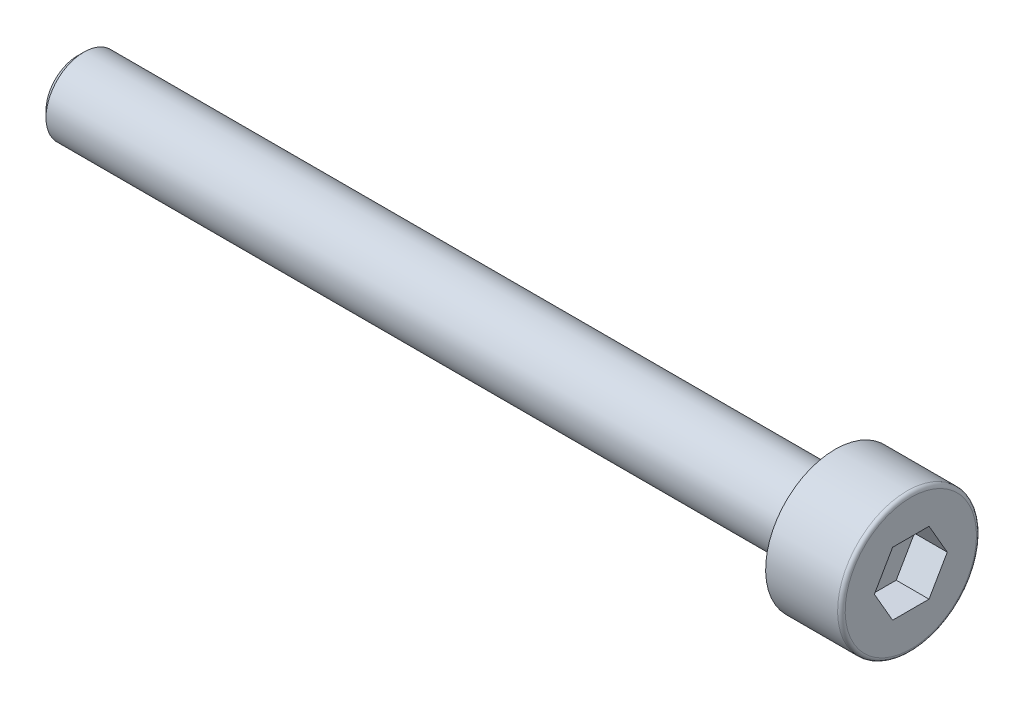
ISO-10303-21;
HEADER;
FILE_DESCRIPTION(('STEP AP214'),'2;1');
FILE_NAME('part.step','',(''),(''),'','','');
FILE_SCHEMA(('AUTOMOTIVE_DESIGN { 1 0 10303 214 1 1 1 1 }'));
ENDSEC;
DATA;
#1=APPLICATION_CONTEXT('core data for automotive mechanical design processes');
#2=APPLICATION_PROTOCOL_DEFINITION('international standard','automotive_design',2000,#1);
#3=PRODUCT_CONTEXT('',#1,'mechanical');
#4=PRODUCT('Part','Part','',(#3));
#5=PRODUCT_RELATED_PRODUCT_CATEGORY('part','',(#4));
#6=PRODUCT_DEFINITION_FORMATION('','',#4);
#7=PRODUCT_DEFINITION_CONTEXT('part definition',#1,'design');
#8=PRODUCT_DEFINITION('design','',#6,#7);
#9=PRODUCT_DEFINITION_SHAPE('','',#8);
#10=(LENGTH_UNIT() NAMED_UNIT(*) SI_UNIT(.MILLI.,.METRE.));
#11=(NAMED_UNIT(*) PLANE_ANGLE_UNIT() SI_UNIT($,.RADIAN.));
#12=(NAMED_UNIT(*) SI_UNIT($,.STERADIAN.) SOLID_ANGLE_UNIT());
#13=UNCERTAINTY_MEASURE_WITH_UNIT(LENGTH_MEASURE(1.E-05),#10,'distance_accuracy_value','');
#14=(GEOMETRIC_REPRESENTATION_CONTEXT(3) GLOBAL_UNCERTAINTY_ASSIGNED_CONTEXT((#13)) GLOBAL_UNIT_ASSIGNED_CONTEXT((#10,
#11,#12)) REPRESENTATION_CONTEXT('',''));
#15=CARTESIAN_POINT('',(0.,0.,0.));
#16=DIRECTION('',(0.,0.,1.));
#17=DIRECTION('',(1.,0.,0.));
#18=AXIS2_PLACEMENT_3D('',#15,#16,#17);
#19=CARTESIAN_POINT('',(0.,0.,0.));
#20=DIRECTION('',(1.,0.,0.));
#21=DIRECTION('',(0.,1.,0.));
#22=AXIS2_PLACEMENT_3D('',#19,#20,#21);
#23=PLANE('',#22);
#24=DIRECTION('',(0.,-0.866025403784439,0.5));
#25=VECTOR('',#24,1.);
#26=CARTESIAN_POINT('',(0.,1.25,0.721687836487035));
#27=LINE('',#26,#25);
#28=CARTESIAN_POINT('',(0.,1.25,0.721687836487035));
#29=VERTEX_POINT('',#28);
#30=CARTESIAN_POINT('',(0.,0.,1.44337567297407));
#31=VERTEX_POINT('',#30);
#32=EDGE_CURVE('E30',#29,#31,#27,.T.);
#33=ORIENTED_EDGE('',*,*,#32,.F.);
#34=DIRECTION('',(0.,0.,1.));
#35=VECTOR('',#34,1.);
#36=CARTESIAN_POINT('',(0.,1.25,-0.721687836487035));
#37=LINE('',#36,#35);
#38=CARTESIAN_POINT('',(0.,1.25,-0.721687836487035));
#39=VERTEX_POINT('',#38);
#40=EDGE_CURVE('E113',#39,#29,#37,.T.);
#41=ORIENTED_EDGE('',*,*,#40,.F.);
#42=DIRECTION('',(0.,0.866025403784439,0.5));
#43=VECTOR('',#42,1.);
#44=CARTESIAN_POINT('',(0.,0.,-1.44337567297406));
#45=LINE('',#44,#43);
#46=CARTESIAN_POINT('',(0.,0.,-1.44337567297406));
#47=VERTEX_POINT('',#46);
#48=EDGE_CURVE('E111',#47,#39,#45,.T.);
#49=ORIENTED_EDGE('',*,*,#48,.F.);
#50=DIRECTION('',(0.,0.866025403784439,-0.5));
#51=VECTOR('',#50,1.);
#52=CARTESIAN_POINT('',(0.,-1.25,-0.721687836487029));
#53=LINE('',#52,#51);
#54=CARTESIAN_POINT('',(0.,-1.25,-0.721687836487029));
#55=VERTEX_POINT('',#54);
#56=EDGE_CURVE('E78',#55,#47,#53,.T.);
#57=ORIENTED_EDGE('',*,*,#56,.F.);
#58=DIRECTION('',(0.,0.,-1.));
#59=VECTOR('',#58,1.);
#60=CARTESIAN_POINT('',(0.,-1.25,0.721687836487035));
#61=LINE('',#60,#59);
#62=CARTESIAN_POINT('',(0.,-1.25,0.721687836487035));
#63=VERTEX_POINT('',#62);
#64=EDGE_CURVE('E107',#63,#55,#61,.T.);
#65=ORIENTED_EDGE('',*,*,#64,.F.);
#66=DIRECTION('',(0.,-0.866025403784439,-0.5));
#67=VECTOR('',#66,1.);
#68=CARTESIAN_POINT('',(0.,0.,1.44337567297407));
#69=LINE('',#68,#67);
#70=EDGE_CURVE('E104',#31,#63,#69,.T.);
#71=ORIENTED_EDGE('',*,*,#70,.F.);
#72=EDGE_LOOP('',(#33,#41,#49,#57,#65,#71));
#73=FACE_BOUND('',#72,.T.);
#74=CARTESIAN_POINT('',(0.,0.,0.));
#75=DIRECTION('',(1.,0.,0.));
#76=DIRECTION('',(0.,1.,0.));
#77=AXIS2_PLACEMENT_3D('',#74,#75,#76);
#78=CIRCLE('',#77,2.6);
#79=CARTESIAN_POINT('',(0.,2.6,0.));
#80=VERTEX_POINT('',#79);
#81=EDGE_CURVE('E131',#80,#80,#78,.T.);
#82=ORIENTED_EDGE('',*,*,#81,.T.);
#83=EDGE_LOOP('',(#82));
#84=FACE_BOUND('',#83,.T.);
#85=ADVANCED_FACE('F15',(#73,#84),#23,.T.);
#86=CARTESIAN_POINT('',(-0.15,0.,0.));
#87=DIRECTION('',(1.,0.,0.));
#88=DIRECTION('',(0.,1.,0.));
#89=AXIS2_PLACEMENT_3D('',#86,#87,#88);
#90=TOROIDAL_SURFACE('',#89,2.6,0.15);
#91=CARTESIAN_POINT('',(-0.15,0.,0.));
#92=DIRECTION('',(1.,0.,0.));
#93=DIRECTION('',(0.,1.,0.));
#94=AXIS2_PLACEMENT_3D('',#91,#92,#93);
#95=CIRCLE('',#94,2.75);
#96=CARTESIAN_POINT('',(-0.15,2.75,0.));
#97=VERTEX_POINT('',#96);
#98=EDGE_CURVE('E128',#97,#97,#95,.T.);
#99=ORIENTED_EDGE('',*,*,#98,.T.);
#100=EDGE_LOOP('',(#99));
#101=FACE_BOUND('',#100,.T.);
#102=ORIENTED_EDGE('',*,*,#81,.F.);
#103=EDGE_LOOP('',(#102));
#104=FACE_BOUND('',#103,.T.);
#105=ADVANCED_FACE('F150',(#101,#104),#90,.T.);
#106=CARTESIAN_POINT('',(0.,0.,0.));
#107=DIRECTION('',(1.,0.,0.));
#108=DIRECTION('',(0.,1.,0.));
#109=AXIS2_PLACEMENT_3D('',#106,#107,#108);
#110=CYLINDRICAL_SURFACE('',#109,2.75);
#111=CARTESIAN_POINT('',(-3.,0.,0.));
#112=DIRECTION('',(1.,0.,0.));
#113=DIRECTION('',(0.,1.,0.));
#114=AXIS2_PLACEMENT_3D('',#111,#112,#113);
#115=CIRCLE('',#114,2.75);
#116=CARTESIAN_POINT('',(-3.,2.75,0.));
#117=VERTEX_POINT('',#116);
#118=EDGE_CURVE('E125',#117,#117,#115,.T.);
#119=ORIENTED_EDGE('',*,*,#118,.T.);
#120=EDGE_LOOP('',(#119));
#121=FACE_BOUND('',#120,.T.);
#122=ORIENTED_EDGE('',*,*,#98,.F.);
#123=EDGE_LOOP('',(#122));
#124=FACE_BOUND('',#123,.T.);
#125=ADVANCED_FACE('F156',(#121,#124),#110,.T.);
#126=CARTESIAN_POINT('',(-3.,2.75,0.));
#127=DIRECTION('',(-1.,0.,0.));
#128=DIRECTION('',(0.,-1.,0.));
#129=AXIS2_PLACEMENT_3D('',#126,#127,#128);
#130=PLANE('',#129);
#131=CARTESIAN_POINT('',(-3.,0.,0.));
#132=DIRECTION('',(1.,0.,0.));
#133=DIRECTION('',(0.,1.,0.));
#134=AXIS2_PLACEMENT_3D('',#131,#132,#133);
#135=CIRCLE('',#134,1.5);
#136=CARTESIAN_POINT('',(-3.,1.5,0.));
#137=VERTEX_POINT('',#136);
#138=EDGE_CURVE('E117',#137,#137,#135,.T.);
#139=ORIENTED_EDGE('',*,*,#138,.T.);
#140=EDGE_LOOP('',(#139));
#141=FACE_BOUND('',#140,.T.);
#142=ORIENTED_EDGE('',*,*,#118,.F.);
#143=EDGE_LOOP('',(#142));
#144=FACE_BOUND('',#143,.T.);
#145=ADVANCED_FACE('F163',(#141,#144),#130,.T.);
#146=CARTESIAN_POINT('',(0.,0.,0.));
#147=DIRECTION('',(1.,0.,0.));
#148=DIRECTION('',(0.,1.,0.));
#149=AXIS2_PLACEMENT_3D('',#146,#147,#148);
#150=CYLINDRICAL_SURFACE('',#149,1.5);
#151=CARTESIAN_POINT('',(-32.75,0.,0.));
#152=DIRECTION('',(-1.,0.,0.));
#153=DIRECTION('',(0.,-1.,0.));
#154=AXIS2_PLACEMENT_3D('',#151,#152,#153);
#155=CIRCLE('',#154,1.5);
#156=CARTESIAN_POINT('',(-32.75,-1.5,0.));
#157=VERTEX_POINT('',#156);
#158=EDGE_CURVE('E23',#157,#157,#155,.F.);
#159=ORIENTED_EDGE('',*,*,#158,.T.);
#160=EDGE_LOOP('',(#159));
#161=FACE_BOUND('',#160,.T.);
#162=ORIENTED_EDGE('',*,*,#138,.F.);
#163=EDGE_LOOP('',(#162));
#164=FACE_BOUND('',#163,.T.);
#165=ADVANCED_FACE('F136',(#161,#164),#150,.T.);
#166=CARTESIAN_POINT('',(-33.,1.5,0.));
#167=DIRECTION('',(-1.,0.,0.));
#168=DIRECTION('',(0.,-1.,0.));
#169=AXIS2_PLACEMENT_3D('',#166,#167,#168);
#170=PLANE('',#169);
#171=CARTESIAN_POINT('',(-33.,0.,0.));
#172=DIRECTION('',(-1.,0.,0.));
#173=DIRECTION('',(0.,-1.,0.));
#174=AXIS2_PLACEMENT_3D('',#171,#172,#173);
#175=CIRCLE('',#174,1.25);
#176=CARTESIAN_POINT('',(-33.,-1.25,0.));
#177=VERTEX_POINT('',#176);
#178=EDGE_CURVE('E9',#177,#177,#175,.T.);
#179=ORIENTED_EDGE('',*,*,#178,.T.);
#180=EDGE_LOOP('',(#179));
#181=FACE_BOUND('',#180,.T.);
#182=ADVANCED_FACE('F170',(#181),#170,.T.);
#183=CARTESIAN_POINT('',(-1.3,1.25,0.721687836487035));
#184=DIRECTION('',(0.,0.5,0.866025403784439));
#185=DIRECTION('',(0.,-0.866025403784439,0.5));
#186=AXIS2_PLACEMENT_3D('',#183,#184,#185);
#187=PLANE('',#186);
#188=ORIENTED_EDGE('',*,*,#32,.T.);
#189=DIRECTION('',(1.,0.,0.));
#190=VECTOR('',#189,1.);
#191=CARTESIAN_POINT('',(-1.3,0.,1.44337567297407));
#192=LINE('',#191,#190);
#193=CARTESIAN_POINT('',(-1.3,0.,1.44337567297407));
#194=VERTEX_POINT('',#193);
#195=EDGE_CURVE('E60',#194,#31,#192,.T.);
#196=ORIENTED_EDGE('',*,*,#195,.F.);
#197=DIRECTION('',(0.,-0.866025403784439,0.5));
#198=VECTOR('',#197,1.);
#199=CARTESIAN_POINT('',(-1.3,1.25,0.721687836487035));
#200=LINE('',#199,#198);
#201=CARTESIAN_POINT('',(-1.3,1.25,0.721687836487035));
#202=VERTEX_POINT('',#201);
#203=EDGE_CURVE('E115',#202,#194,#200,.T.);
#204=ORIENTED_EDGE('',*,*,#203,.F.);
#205=DIRECTION('',(1.,0.,0.));
#206=VECTOR('',#205,1.);
#207=CARTESIAN_POINT('',(-1.3,1.25,0.721687836487035));
#208=LINE('',#207,#206);
#209=EDGE_CURVE('E38',#202,#29,#208,.T.);
#210=ORIENTED_EDGE('',*,*,#209,.T.);
#211=EDGE_LOOP('',(#188,#196,#204,#210));
#212=FACE_BOUND('',#211,.T.);
#213=ADVANCED_FACE('F173',(#212),#187,.F.);
#214=CARTESIAN_POINT('',(-1.3,1.25,-0.721687836487035));
#215=DIRECTION('',(0.,1.,0.));
#216=DIRECTION('',(-1.,0.,0.));
#217=AXIS2_PLACEMENT_3D('',#214,#215,#216);
#218=PLANE('',#217);
#219=ORIENTED_EDGE('',*,*,#40,.T.);
#220=ORIENTED_EDGE('',*,*,#209,.F.);
#221=DIRECTION('',(0.,0.,1.));
#222=VECTOR('',#221,1.);
#223=CARTESIAN_POINT('',(-1.3,1.25,-0.721687836487035));
#224=LINE('',#223,#222);
#225=CARTESIAN_POINT('',(-1.3,1.25,-0.721687836487035));
#226=VERTEX_POINT('',#225);
#227=EDGE_CURVE('E90',#226,#202,#224,.T.);
#228=ORIENTED_EDGE('',*,*,#227,.F.);
#229=DIRECTION('',(1.,0.,0.));
#230=VECTOR('',#229,1.);
#231=CARTESIAN_POINT('',(-1.3,1.25,-0.721687836487035));
#232=LINE('',#231,#230);
#233=EDGE_CURVE('E82',#226,#39,#232,.T.);
#234=ORIENTED_EDGE('',*,*,#233,.T.);
#235=EDGE_LOOP('',(#219,#220,#228,#234));
#236=FACE_BOUND('',#235,.T.);
#237=ADVANCED_FACE('F177',(#236),#218,.F.);
#238=CARTESIAN_POINT('',(-1.3,0.,-1.44337567297406));
#239=DIRECTION('',(0.,0.5,-0.866025403784439));
#240=DIRECTION('',(0.,0.866025403784439,0.5));
#241=AXIS2_PLACEMENT_3D('',#238,#239,#240);
#242=PLANE('',#241);
#243=ORIENTED_EDGE('',*,*,#48,.T.);
#244=ORIENTED_EDGE('',*,*,#233,.F.);
#245=DIRECTION('',(0.,0.866025403784439,0.5));
#246=VECTOR('',#245,1.);
#247=CARTESIAN_POINT('',(-1.3,0.,-1.44337567297406));
#248=LINE('',#247,#246);
#249=CARTESIAN_POINT('',(-1.3,0.,-1.44337567297406));
#250=VERTEX_POINT('',#249);
#251=EDGE_CURVE('E86',#250,#226,#248,.T.);
#252=ORIENTED_EDGE('',*,*,#251,.F.);
#253=DIRECTION('',(1.,0.,0.));
#254=VECTOR('',#253,1.);
#255=CARTESIAN_POINT('',(-1.3,0.,-1.44337567297406));
#256=LINE('',#255,#254);
#257=EDGE_CURVE('E71',#250,#47,#256,.T.);
#258=ORIENTED_EDGE('',*,*,#257,.T.);
#259=EDGE_LOOP('',(#243,#244,#252,#258));
#260=FACE_BOUND('',#259,.T.);
#261=ADVANCED_FACE('F87',(#260),#242,.F.);
#262=CARTESIAN_POINT('',(-1.3,-1.25,-0.721687836487029));
#263=DIRECTION('',(0.,-0.5,-0.866025403784439));
#264=DIRECTION('',(0.,0.866025403784439,-0.5));
#265=AXIS2_PLACEMENT_3D('',#262,#263,#264);
#266=PLANE('',#265);
#267=ORIENTED_EDGE('',*,*,#56,.T.);
#268=ORIENTED_EDGE('',*,*,#257,.F.);
#269=DIRECTION('',(0.,0.866025403784439,-0.5));
#270=VECTOR('',#269,1.);
#271=CARTESIAN_POINT('',(-1.3,-1.25,-0.721687836487029));
#272=LINE('',#271,#270);
#273=CARTESIAN_POINT('',(-1.3,-1.25,-0.721687836487029));
#274=VERTEX_POINT('',#273);
#275=EDGE_CURVE('E75',#274,#250,#272,.T.);
#276=ORIENTED_EDGE('',*,*,#275,.F.);
#277=DIRECTION('',(1.,0.,0.));
#278=VECTOR('',#277,1.);
#279=CARTESIAN_POINT('',(-1.3,-1.25,-0.721687836487029));
#280=LINE('',#279,#278);
#281=EDGE_CURVE('E83',#274,#55,#280,.T.);
#282=ORIENTED_EDGE('',*,*,#281,.T.);
#283=EDGE_LOOP('',(#267,#268,#276,#282));
#284=FACE_BOUND('',#283,.T.);
#285=ADVANCED_FACE('F73',(#284),#266,.F.);
#286=CARTESIAN_POINT('',(-1.3,-1.25,0.721687836487035));
#287=DIRECTION('',(0.,-1.,0.));
#288=DIRECTION('',(0.,0.,-1.));
#289=AXIS2_PLACEMENT_3D('',#286,#287,#288);
#290=PLANE('',#289);
#291=ORIENTED_EDGE('',*,*,#64,.T.);
#292=ORIENTED_EDGE('',*,*,#281,.F.);
#293=DIRECTION('',(0.,0.,-1.));
#294=VECTOR('',#293,1.);
#295=CARTESIAN_POINT('',(-1.3,-1.25,0.721687836487035));
#296=LINE('',#295,#294);
#297=CARTESIAN_POINT('',(-1.3,-1.25,0.721687836487035));
#298=VERTEX_POINT('',#297);
#299=EDGE_CURVE('E96',#298,#274,#296,.T.);
#300=ORIENTED_EDGE('',*,*,#299,.F.);
#301=DIRECTION('',(1.,0.,0.));
#302=VECTOR('',#301,1.);
#303=CARTESIAN_POINT('',(-1.3,-1.25,0.721687836487035));
#304=LINE('',#303,#302);
#305=EDGE_CURVE('E120',#298,#63,#304,.T.);
#306=ORIENTED_EDGE('',*,*,#305,.T.);
#307=EDGE_LOOP('',(#291,#292,#300,#306));
#308=FACE_BOUND('',#307,.T.);
#309=ADVANCED_FACE('F180',(#308),#290,.F.);
#310=CARTESIAN_POINT('',(-1.3,0.,1.44337567297407));
#311=DIRECTION('',(0.,-0.5,0.866025403784439));
#312=DIRECTION('',(0.,-0.866025403784439,-0.5));
#313=AXIS2_PLACEMENT_3D('',#310,#311,#312);
#314=PLANE('',#313);
#315=ORIENTED_EDGE('',*,*,#70,.T.);
#316=ORIENTED_EDGE('',*,*,#305,.F.);
#317=DIRECTION('',(0.,-0.866025403784439,-0.5));
#318=VECTOR('',#317,1.);
#319=CARTESIAN_POINT('',(-1.3,0.,1.44337567297407));
#320=LINE('',#319,#318);
#321=EDGE_CURVE('E98',#194,#298,#320,.T.);
#322=ORIENTED_EDGE('',*,*,#321,.F.);
#323=ORIENTED_EDGE('',*,*,#195,.T.);
#324=EDGE_LOOP('',(#315,#316,#322,#323));
#325=FACE_BOUND('',#324,.T.);
#326=ADVANCED_FACE('F146',(#325),#314,.F.);
#327=CARTESIAN_POINT('',(-1.3,0.,1.44337567297407));
#328=DIRECTION('',(1.,0.,0.));
#329=DIRECTION('',(0.,1.,0.));
#330=AXIS2_PLACEMENT_3D('',#327,#328,#329);
#331=PLANE('',#330);
#332=ORIENTED_EDGE('',*,*,#203,.T.);
#333=ORIENTED_EDGE('',*,*,#321,.T.);
#334=ORIENTED_EDGE('',*,*,#299,.T.);
#335=ORIENTED_EDGE('',*,*,#275,.T.);
#336=ORIENTED_EDGE('',*,*,#251,.T.);
#337=ORIENTED_EDGE('',*,*,#227,.T.);
#338=EDGE_LOOP('',(#332,#333,#334,#335,#336,#337));
#339=FACE_BOUND('',#338,.T.);
#340=ADVANCED_FACE('F93',(#339),#331,.T.);
#341=CARTESIAN_POINT('',(-32.75,0.,0.));
#342=DIRECTION('',(1.,0.,0.));
#343=DIRECTION('',(0.,1.,0.));
#344=AXIS2_PLACEMENT_3D('',#341,#342,#343);
#345=CONICAL_SURFACE('',#344,1.5,0.785398163397445);
#346=ORIENTED_EDGE('',*,*,#178,.F.);
#347=EDGE_LOOP('',(#346));
#348=FACE_BOUND('',#347,.T.);
#349=ORIENTED_EDGE('',*,*,#158,.F.);
#350=EDGE_LOOP('',(#349));
#351=FACE_BOUND('',#350,.T.);
#352=ADVANCED_FACE('F17',(#348,#351),#345,.T.);
#353=CLOSED_SHELL('',(#85,#105,#125,#145,#165,#182,#213,#237,#261,#285,#309,#326,#340,#352));
#354=MANIFOLD_SOLID_BREP('B1',#353);
#355=ADVANCED_BREP_SHAPE_REPRESENTATION('',(#18,#354),#14);
#356=SHAPE_DEFINITION_REPRESENTATION(#9,#355);
ENDSEC;
END-ISO-10303-21;
